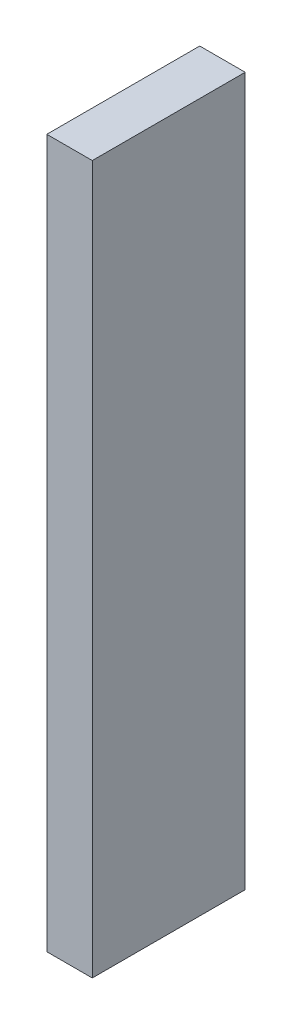
ISO-10303-21;
HEADER;
FILE_DESCRIPTION(('STEP AP214'),'2;1');
FILE_NAME('part.step','',(''),(''),'','','');
FILE_SCHEMA(('AUTOMOTIVE_DESIGN { 1 0 10303 214 1 1 1 1 }'));
ENDSEC;
DATA;
#1=APPLICATION_CONTEXT('core data for automotive mechanical design processes');
#2=APPLICATION_PROTOCOL_DEFINITION('international standard','automotive_design',2000,#1);
#3=PRODUCT_CONTEXT('',#1,'mechanical');
#4=PRODUCT('Part','Part','',(#3));
#5=PRODUCT_RELATED_PRODUCT_CATEGORY('part','',(#4));
#6=PRODUCT_DEFINITION_FORMATION('','',#4);
#7=PRODUCT_DEFINITION_CONTEXT('part definition',#1,'design');
#8=PRODUCT_DEFINITION('design','',#6,#7);
#9=PRODUCT_DEFINITION_SHAPE('','',#8);
#10=(LENGTH_UNIT() NAMED_UNIT(*) SI_UNIT(.MILLI.,.METRE.));
#11=(NAMED_UNIT(*) PLANE_ANGLE_UNIT() SI_UNIT($,.RADIAN.));
#12=(NAMED_UNIT(*) SI_UNIT($,.STERADIAN.) SOLID_ANGLE_UNIT());
#13=UNCERTAINTY_MEASURE_WITH_UNIT(LENGTH_MEASURE(1.E-05),#10,'distance_accuracy_value','');
#14=(GEOMETRIC_REPRESENTATION_CONTEXT(3) GLOBAL_UNCERTAINTY_ASSIGNED_CONTEXT((#13)) GLOBAL_UNIT_ASSIGNED_CONTEXT((#10,
#11,#12)) REPRESENTATION_CONTEXT('',''));
#15=CARTESIAN_POINT('',(0.,0.,0.));
#16=DIRECTION('',(0.,0.,1.));
#17=DIRECTION('',(1.,0.,0.));
#18=AXIS2_PLACEMENT_3D('',#15,#16,#17);
#19=CARTESIAN_POINT('',(130.275545212479,22.4180708263693,86.0720244776067));
#20=DIRECTION('',(-1.69244514382854E-09,0.,1.));
#21=DIRECTION('',(1.,0.,1.69244514382854E-09));
#22=AXIS2_PLACEMENT_3D('',#19,#20,#21);
#23=PLANE('',#22);
#24=DIRECTION('',(0.,-1.,0.));
#25=VECTOR('',#24,1.);
#26=CARTESIAN_POINT('',(131.258630309492,22.4180708263693,86.0720244792705));
#27=LINE('',#26,#25);
#28=CARTESIAN_POINT('',(131.258630309492,22.4180708263693,86.0720244792705));
#29=VERTEX_POINT('',#28);
#30=CARTESIAN_POINT('',(131.258630309492,7.11212965552236,86.0720244792705));
#31=VERTEX_POINT('',#30);
#32=EDGE_CURVE('E79',#29,#31,#27,.T.);
#33=ORIENTED_EDGE('',*,*,#32,.F.);
#34=DIRECTION('',(1.,0.,1.69244514382854E-09));
#35=VECTOR('',#34,1.);
#36=CARTESIAN_POINT('',(130.275545212479,22.4180708263693,86.0720244776067));
#37=LINE('',#36,#35);
#38=CARTESIAN_POINT('',(130.275545212479,22.4180708263693,86.0720244776067));
#39=VERTEX_POINT('',#38);
#40=EDGE_CURVE('E32',#39,#29,#37,.T.);
#41=ORIENTED_EDGE('',*,*,#40,.F.);
#42=DIRECTION('',(0.,-1.,0.));
#43=VECTOR('',#42,1.);
#44=CARTESIAN_POINT('',(130.275545212479,22.4180708263693,86.0720244776067));
#45=LINE('',#44,#43);
#46=CARTESIAN_POINT('',(130.275545212479,7.11212965552236,86.0720244776067));
#47=VERTEX_POINT('',#46);
#48=EDGE_CURVE('E71',#39,#47,#45,.T.);
#49=ORIENTED_EDGE('',*,*,#48,.T.);
#50=DIRECTION('',(1.,0.,1.69244514382854E-09));
#51=VECTOR('',#50,1.);
#52=CARTESIAN_POINT('',(130.275545212479,7.11212965552236,86.0720244776067));
#53=LINE('',#52,#51);
#54=EDGE_CURVE('E10',#47,#31,#53,.T.);
#55=ORIENTED_EDGE('',*,*,#54,.T.);
#56=EDGE_LOOP('',(#33,#41,#49,#55));
#57=FACE_BOUND('',#56,.T.);
#58=ADVANCED_FACE('F16',(#57),#23,.T.);
#59=CARTESIAN_POINT('',(130.275545212479,7.11212965552236,86.0720244776067));
#60=DIRECTION('',(0.,-1.,0.));
#61=DIRECTION('',(0.,0.,-1.));
#62=AXIS2_PLACEMENT_3D('',#59,#60,#61);
#63=PLANE('',#62);
#64=DIRECTION('',(1.69244514382854E-09,0.,-1.));
#65=VECTOR('',#64,1.);
#66=CARTESIAN_POINT('',(131.258630309492,7.11212965552236,86.0720244792705));
#67=LINE('',#66,#65);
#68=CARTESIAN_POINT('',(131.258630315087,7.11212965552235,82.7660833084218));
#69=VERTEX_POINT('',#68);
#70=EDGE_CURVE('E82',#31,#69,#67,.T.);
#71=ORIENTED_EDGE('',*,*,#70,.F.);
#72=ORIENTED_EDGE('',*,*,#54,.F.);
#73=DIRECTION('',(1.69244514382854E-09,0.,-1.));
#74=VECTOR('',#73,1.);
#75=CARTESIAN_POINT('',(130.275545212479,7.11212965552236,86.0720244776067));
#76=LINE('',#75,#74);
#77=CARTESIAN_POINT('',(130.275545218074,7.11212965552235,82.766083306758));
#78=VERTEX_POINT('',#77);
#79=EDGE_CURVE('E67',#47,#78,#76,.T.);
#80=ORIENTED_EDGE('',*,*,#79,.T.);
#81=DIRECTION('',(1.,0.,1.69244514382854E-09));
#82=VECTOR('',#81,1.);
#83=CARTESIAN_POINT('',(130.275545218074,7.11212965552235,82.766083306758));
#84=LINE('',#83,#82);
#85=EDGE_CURVE('E24',#78,#69,#84,.T.);
#86=ORIENTED_EDGE('',*,*,#85,.T.);
#87=EDGE_LOOP('',(#71,#72,#80,#86));
#88=FACE_BOUND('',#87,.T.);
#89=ADVANCED_FACE('F68',(#88),#63,.T.);
#90=CARTESIAN_POINT('',(130.275545218074,7.11212965552235,82.766083306758));
#91=DIRECTION('',(1.69244514382854E-09,0.,-1.));
#92=DIRECTION('',(-1.,0.,-1.69244514382854E-09));
#93=AXIS2_PLACEMENT_3D('',#90,#91,#92);
#94=PLANE('',#93);
#95=DIRECTION('',(0.,1.,0.));
#96=VECTOR('',#95,1.);
#97=CARTESIAN_POINT('',(131.258630315087,7.11212965552235,82.7660833084218));
#98=LINE('',#97,#96);
#99=CARTESIAN_POINT('',(131.258630315087,22.418070826371,82.7660832999612));
#100=VERTEX_POINT('',#99);
#101=EDGE_CURVE('E65',#69,#100,#98,.T.);
#102=ORIENTED_EDGE('',*,*,#101,.F.);
#103=ORIENTED_EDGE('',*,*,#85,.F.);
#104=DIRECTION('',(0.,1.,0.));
#105=VECTOR('',#104,1.);
#106=CARTESIAN_POINT('',(130.275545218074,7.11212965552235,82.766083306758));
#107=LINE('',#106,#105);
#108=CARTESIAN_POINT('',(130.275545218074,22.418070826371,82.7660832982974));
#109=VERTEX_POINT('',#108);
#110=EDGE_CURVE('E62',#78,#109,#107,.T.);
#111=ORIENTED_EDGE('',*,*,#110,.T.);
#112=DIRECTION('',(1.,0.,1.69244514382854E-09));
#113=VECTOR('',#112,1.);
#114=CARTESIAN_POINT('',(130.275545218074,22.418070826371,82.7660832982974));
#115=LINE('',#114,#113);
#116=EDGE_CURVE('E48',#109,#100,#115,.T.);
#117=ORIENTED_EDGE('',*,*,#116,.T.);
#118=EDGE_LOOP('',(#102,#103,#111,#117));
#119=FACE_BOUND('',#118,.T.);
#120=ADVANCED_FACE('F60',(#119),#94,.T.);
#121=CARTESIAN_POINT('',(130.275545218074,22.418070826371,82.7660832982974));
#122=DIRECTION('',(0.,1.,0.));
#123=DIRECTION('',(-1.,0.,0.));
#124=AXIS2_PLACEMENT_3D('',#121,#122,#123);
#125=PLANE('',#124);
#126=DIRECTION('',(-1.69244514382854E-09,0.,1.));
#127=VECTOR('',#126,1.);
#128=CARTESIAN_POINT('',(131.258630315087,22.418070826371,82.7660832999612));
#129=LINE('',#128,#127);
#130=EDGE_CURVE('E85',#100,#29,#129,.T.);
#131=ORIENTED_EDGE('',*,*,#130,.F.);
#132=ORIENTED_EDGE('',*,*,#116,.F.);
#133=DIRECTION('',(-1.69244514382854E-09,0.,1.));
#134=VECTOR('',#133,1.);
#135=CARTESIAN_POINT('',(130.275545218074,22.418070826371,82.7660832982974));
#136=LINE('',#135,#134);
#137=EDGE_CURVE('E74',#109,#39,#136,.T.);
#138=ORIENTED_EDGE('',*,*,#137,.T.);
#139=ORIENTED_EDGE('',*,*,#40,.T.);
#140=EDGE_LOOP('',(#131,#132,#138,#139));
#141=FACE_BOUND('',#140,.T.);
#142=ADVANCED_FACE('F96',(#141),#125,.T.);
#143=CARTESIAN_POINT('',(130.275545201028,17.2651002409467,92.8378607087388));
#144=DIRECTION('',(1.,0.,1.69244514382854E-09));
#145=DIRECTION('',(0.,1.,0.));
#146=AXIS2_PLACEMENT_3D('',#143,#144,#145);
#147=PLANE('',#146);
#148=ORIENTED_EDGE('',*,*,#48,.F.);
#149=ORIENTED_EDGE('',*,*,#137,.F.);
#150=ORIENTED_EDGE('',*,*,#110,.F.);
#151=ORIENTED_EDGE('',*,*,#79,.F.);
#152=EDGE_LOOP('',(#148,#149,#150,#151));
#153=FACE_BOUND('',#152,.T.);
#154=ADVANCED_FACE('F73',(#153),#147,.F.);
#155=CARTESIAN_POINT('',(131.258630298041,17.2651002409467,92.8378607104026));
#156=DIRECTION('',(1.,0.,1.69244514382854E-09));
#157=DIRECTION('',(0.,1.,0.));
#158=AXIS2_PLACEMENT_3D('',#155,#156,#157);
#159=PLANE('',#158);
#160=ORIENTED_EDGE('',*,*,#32,.T.);
#161=ORIENTED_EDGE('',*,*,#70,.T.);
#162=ORIENTED_EDGE('',*,*,#101,.T.);
#163=ORIENTED_EDGE('',*,*,#130,.T.);
#164=EDGE_LOOP('',(#160,#161,#162,#163));
#165=FACE_BOUND('',#164,.T.);
#166=ADVANCED_FACE('F89',(#165),#159,.T.);
#167=CLOSED_SHELL('',(#58,#89,#120,#142,#154,#166));
#168=MANIFOLD_SOLID_BREP('B1',#167);
#169=ADVANCED_BREP_SHAPE_REPRESENTATION('',(#18,#168),#14);
#170=SHAPE_DEFINITION_REPRESENTATION(#9,#169);
ENDSEC;
END-ISO-10303-21;
